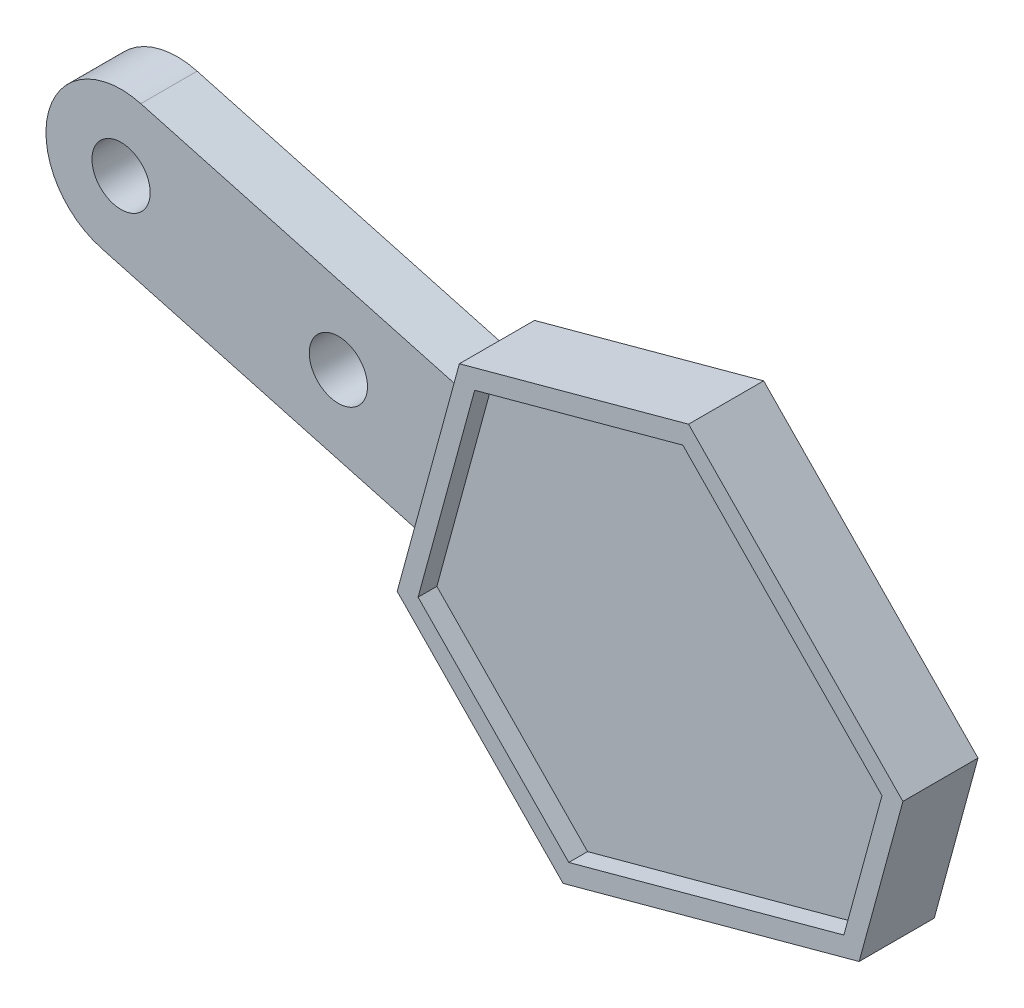
ISO-10303-21;
HEADER;
FILE_DESCRIPTION(('STEP AP214'),'2;1');
FILE_NAME('part.step','',(''),(''),'','','');
FILE_SCHEMA(('AUTOMOTIVE_DESIGN { 1 0 10303 214 1 1 1 1 }'));
ENDSEC;
DATA;
#1=APPLICATION_CONTEXT('core data for automotive mechanical design processes');
#2=APPLICATION_PROTOCOL_DEFINITION('international standard','automotive_design',2000,#1);
#3=PRODUCT_CONTEXT('',#1,'mechanical');
#4=PRODUCT('Part','Part','',(#3));
#5=PRODUCT_RELATED_PRODUCT_CATEGORY('part','',(#4));
#6=PRODUCT_DEFINITION_FORMATION('','',#4);
#7=PRODUCT_DEFINITION_CONTEXT('part definition',#1,'design');
#8=PRODUCT_DEFINITION('design','',#6,#7);
#9=PRODUCT_DEFINITION_SHAPE('','',#8);
#10=(LENGTH_UNIT() NAMED_UNIT(*) SI_UNIT(.MILLI.,.METRE.));
#11=(NAMED_UNIT(*) PLANE_ANGLE_UNIT() SI_UNIT($,.RADIAN.));
#12=(NAMED_UNIT(*) SI_UNIT($,.STERADIAN.) SOLID_ANGLE_UNIT());
#13=UNCERTAINTY_MEASURE_WITH_UNIT(LENGTH_MEASURE(1.E-05),#10,'distance_accuracy_value','');
#14=(GEOMETRIC_REPRESENTATION_CONTEXT(3) GLOBAL_UNCERTAINTY_ASSIGNED_CONTEXT((#13)) GLOBAL_UNIT_ASSIGNED_CONTEXT((#10,
#11,#12)) REPRESENTATION_CONTEXT('',''));
#15=CARTESIAN_POINT('',(0.,0.,0.));
#16=DIRECTION('',(0.,0.,1.));
#17=DIRECTION('',(1.,0.,0.));
#18=AXIS2_PLACEMENT_3D('',#15,#16,#17);
#19=CARTESIAN_POINT('',(38.1207531360918,-10.3903817993219,3.));
#20=DIRECTION('',(0.964803560931518,-0.262971650209416,0.));
#21=DIRECTION('',(0.262971650209416,0.964803560931518,0.));
#22=AXIS2_PLACEMENT_3D('',#19,#20,#21);
#23=PLANE('',#22);
#24=DIRECTION('',(-0.262971650209416,-0.964803560931518,0.));
#25=VECTOR('',#24,1.);
#26=CARTESIAN_POINT('',(38.1207531360918,-10.3903817993219,0.));
#27=LINE('',#26,#25);
#28=CARTESIAN_POINT('',(51.127591798776,37.3297593194111,0.));
#29=VERTEX_POINT('',#28);
#30=CARTESIAN_POINT('',(48.7962458042552,28.776400371837,0.));
#31=VERTEX_POINT('',#30);
#32=EDGE_CURVE('E233',#29,#31,#27,.T.);
#33=ORIENTED_EDGE('',*,*,#32,.F.);
#34=DIRECTION('',(0.,0.,-1.));
#35=VECTOR('',#34,1.);
#36=CARTESIAN_POINT('',(51.127591798776,37.3297593194111,3.));
#37=LINE('',#36,#35);
#38=CARTESIAN_POINT('',(51.127591798776,37.3297593194111,4.));
#39=VERTEX_POINT('',#38);
#40=EDGE_CURVE('E282',#39,#29,#37,.T.);
#41=ORIENTED_EDGE('',*,*,#40,.F.);
#42=DIRECTION('',(0.262971650209416,0.964803560931518,0.));
#43=VECTOR('',#42,1.);
#44=CARTESIAN_POINT('',(51.127591798776,37.3297593194111,4.));
#45=LINE('',#44,#43);
#46=CARTESIAN_POINT('',(48.7962458042552,28.776400371837,4.));
#47=VERTEX_POINT('',#46);
#48=EDGE_CURVE('E175',#47,#39,#45,.T.);
#49=ORIENTED_EDGE('',*,*,#48,.F.);
#50=DIRECTION('',(0.,0.,-1.));
#51=VECTOR('',#50,1.);
#52=CARTESIAN_POINT('',(48.7962458042552,28.776400371837,3.));
#53=LINE('',#52,#51);
#54=EDGE_CURVE('E263',#47,#31,#53,.T.);
#55=ORIENTED_EDGE('',*,*,#54,.T.);
#56=EDGE_LOOP('',(#33,#41,#49,#55));
#57=FACE_BOUND('',#56,.T.);
#58=ADVANCED_FACE('F34',(#57),#23,.T.);
#59=CARTESIAN_POINT('',(44.8323643576275,43.7767824762384,3.));
#60=DIRECTION('',(-0.71547962690603,-0.69863359744748,0.));
#61=DIRECTION('',(0.69863359744748,-0.71547962690603,0.));
#62=AXIS2_PLACEMENT_3D('',#59,#60,#61);
#63=PLANE('',#62);
#64=DIRECTION('',(-0.69863359744748,0.71547962690603,0.));
#65=VECTOR('',#64,1.);
#66=CARTESIAN_POINT('',(44.8323643576275,43.7767824762384,0.));
#67=LINE('',#66,#65);
#68=CARTESIAN_POINT('',(39.7087582613538,49.0239331880977,0.));
#69=VERTEX_POINT('',#68);
#70=EDGE_CURVE('E240',#29,#69,#67,.T.);
#71=ORIENTED_EDGE('',*,*,#70,.T.);
#72=DIRECTION('',(0.,0.,-1.));
#73=VECTOR('',#72,1.);
#74=CARTESIAN_POINT('',(39.7087582613538,49.0239331880977,3.));
#75=LINE('',#74,#73);
#76=CARTESIAN_POINT('',(39.7087582613538,49.0239331880977,4.));
#77=VERTEX_POINT('',#76);
#78=EDGE_CURVE('E280',#77,#69,#75,.T.);
#79=ORIENTED_EDGE('',*,*,#78,.F.);
#80=DIRECTION('',(-0.69863359744748,0.715479626906031,0.));
#81=VECTOR('',#80,1.);
#82=CARTESIAN_POINT('',(51.127591798776,37.3297593194111,4.));
#83=LINE('',#82,#81);
#84=EDGE_CURVE('E218',#39,#77,#83,.T.);
#85=ORIENTED_EDGE('',*,*,#84,.F.);
#86=ORIENTED_EDGE('',*,*,#40,.T.);
#87=EDGE_LOOP('',(#71,#79,#85,#86));
#88=FACE_BOUND('',#87,.T.);
#89=ADVANCED_FACE('F316',(#88),#63,.F.);
#90=CARTESIAN_POINT('',(-9.67375651287494,35.6080056345547,3.));
#91=DIRECTION('',(-0.262170893566225,0.965021462231119,0.));
#92=DIRECTION('',(-0.965021462231119,-0.262170893566225,0.));
#93=AXIS2_PLACEMENT_3D('',#90,#91,#92);
#94=PLANE('',#93);
#95=DIRECTION('',(0.965021462231119,0.262170893566225,0.));
#96=VECTOR('',#95,1.);
#97=CARTESIAN_POINT('',(-9.67375651287494,35.6080056345547,0.));
#98=LINE('',#97,#96);
#99=CARTESIAN_POINT('',(27.4988774001279,45.7068304074778,0.));
#100=VERTEX_POINT('',#99);
#101=EDGE_CURVE('E243',#100,#69,#98,.T.);
#102=ORIENTED_EDGE('',*,*,#101,.F.);
#103=DIRECTION('',(0.,0.,-1.));
#104=VECTOR('',#103,1.);
#105=CARTESIAN_POINT('',(27.4988774001279,45.7068304074778,3.));
#106=LINE('',#105,#104);
#107=CARTESIAN_POINT('',(27.4988774001279,45.7068304074778,4.));
#108=VERTEX_POINT('',#107);
#109=EDGE_CURVE('E278',#108,#100,#106,.T.);
#110=ORIENTED_EDGE('',*,*,#109,.F.);
#111=DIRECTION('',(-0.965021462231119,-0.262170893566226,0.));
#112=VECTOR('',#111,1.);
#113=CARTESIAN_POINT('',(27.4988774001279,45.7068304074778,4.));
#114=LINE('',#113,#112);
#115=EDGE_CURVE('E221',#77,#108,#114,.T.);
#116=ORIENTED_EDGE('',*,*,#115,.F.);
#117=ORIENTED_EDGE('',*,*,#78,.T.);
#118=EDGE_LOOP('',(#102,#110,#116,#117));
#119=FACE_BOUND('',#118,.T.);
#120=ADVANCED_FACE('F312',(#119),#94,.T.);
#121=CARTESIAN_POINT('',(12.8930522662611,47.302675888672,3.));
#122=DIRECTION('',(0.262971650209409,0.964803560931519,0.));
#123=DIRECTION('',(-0.964803560931519,0.262971650209409,0.));
#124=AXIS2_PLACEMENT_3D('',#121,#122,#123);
#125=PLANE('',#124);
#126=DIRECTION('',(0.964803560931519,-0.262971650209409,0.));
#127=VECTOR('',#126,1.);
#128=CARTESIAN_POINT('',(12.8930522662611,47.302675888672,0.));
#129=LINE('',#128,#127);
#130=CARTESIAN_POINT('',(9.52725228229794,48.2200750483548,0.));
#131=VERTEX_POINT('',#130);
#132=CARTESIAN_POINT('',(26.8937163790653,43.4865853445854,0.));
#133=VERTEX_POINT('',#132);
#134=EDGE_CURVE('E249',#131,#133,#129,.T.);
#135=ORIENTED_EDGE('',*,*,#134,.F.);
#136=DIRECTION('',(0.,0.,-1.));
#137=VECTOR('',#136,1.);
#138=CARTESIAN_POINT('',(9.52725228229794,48.2200750483548,3.));
#139=LINE('',#138,#137);
#140=CARTESIAN_POINT('',(9.52725228229794,48.2200750483548,3.));
#141=VERTEX_POINT('',#140);
#142=EDGE_CURVE('E59',#131,#141,#139,.F.);
#143=ORIENTED_EDGE('',*,*,#142,.T.);
#144=DIRECTION('',(0.964803560931519,-0.262971650209409,0.));
#145=VECTOR('',#144,1.);
#146=CARTESIAN_POINT('',(12.8930522662611,47.302675888672,3.));
#147=LINE('',#146,#145);
#148=CARTESIAN_POINT('',(26.8937163790653,43.4865853445854,3.));
#149=VERTEX_POINT('',#148);
#150=EDGE_CURVE('E237',#141,#149,#147,.T.);
#151=ORIENTED_EDGE('',*,*,#150,.T.);
#152=DIRECTION('',(0.,0.,-1.));
#153=VECTOR('',#152,1.);
#154=CARTESIAN_POINT('',(26.8937163790653,43.4865853445854,3.));
#155=LINE('',#154,#153);
#156=EDGE_CURVE('E277',#149,#133,#155,.T.);
#157=ORIENTED_EDGE('',*,*,#156,.T.);
#158=EDGE_LOOP('',(#135,#143,#151,#157));
#159=FACE_BOUND('',#158,.T.);
#160=ADVANCED_FACE('F301',(#159),#125,.T.);
#161=CARTESIAN_POINT('',(8.47536568146036,44.3608608046289,3.));
#162=DIRECTION('',(0.,0.,-1.));
#163=DIRECTION('',(-1.,0.,0.));
#164=AXIS2_PLACEMENT_3D('',#161,#162,#163);
#165=CYLINDRICAL_SURFACE('',#164,4.);
#166=CARTESIAN_POINT('',(8.47536568146036,44.3608608046289,0.));
#167=DIRECTION('',(0.,0.,1.));
#168=DIRECTION('',(1.,0.,0.));
#169=AXIS2_PLACEMENT_3D('',#166,#167,#168);
#170=CIRCLE('',#169,4.);
#171=CARTESIAN_POINT('',(4.61615143773429,45.4127474054666,0.));
#172=VERTEX_POINT('',#171);
#173=CARTESIAN_POINT('',(7.4234790806227,40.5016465609029,0.));
#174=VERTEX_POINT('',#173);
#175=EDGE_CURVE('E251',#172,#174,#170,.T.);
#176=ORIENTED_EDGE('',*,*,#175,.T.);
#177=DIRECTION('',(0.,0.,-1.));
#178=VECTOR('',#177,1.);
#179=CARTESIAN_POINT('',(7.4234790806227,40.5016465609029,3.));
#180=LINE('',#179,#178);
#181=CARTESIAN_POINT('',(7.4234790806227,40.5016465609029,3.));
#182=VERTEX_POINT('',#181);
#183=EDGE_CURVE('E271',#182,#174,#180,.T.);
#184=ORIENTED_EDGE('',*,*,#183,.F.);
#185=CARTESIAN_POINT('',(8.47536568146036,44.3608608046289,3.));
#186=DIRECTION('',(0.,0.,1.));
#187=DIRECTION('',(1.,0.,0.));
#188=AXIS2_PLACEMENT_3D('',#185,#186,#187);
#189=CIRCLE('',#188,4.);
#190=CARTESIAN_POINT('',(4.61615143773429,45.4127474054666,3.));
#191=VERTEX_POINT('',#190);
#192=EDGE_CURVE('E234',#191,#182,#189,.T.);
#193=ORIENTED_EDGE('',*,*,#192,.F.);
#194=DIRECTION('',(0.,0.,-1.));
#195=VECTOR('',#194,1.);
#196=CARTESIAN_POINT('',(4.61615143773429,45.4127474054666,3.));
#197=LINE('',#196,#195);
#198=EDGE_CURVE('E274',#191,#172,#197,.T.);
#199=ORIENTED_EDGE('',*,*,#198,.T.);
#200=EDGE_LOOP('',(#176,#184,#193,#199));
#201=FACE_BOUND('',#200,.T.);
#202=ADVANCED_FACE('F338',(#201),#165,.T.);
#203=CARTESIAN_POINT('',(10.7892790645862,39.5842474012199,3.));
#204=DIRECTION('',(0.262971650209416,0.964803560931518,0.));
#205=DIRECTION('',(-0.964803560931518,0.262971650209416,0.));
#206=AXIS2_PLACEMENT_3D('',#203,#204,#205);
#207=PLANE('',#206);
#208=DIRECTION('',(0.964803560931518,-0.262971650209416,0.));
#209=VECTOR('',#208,1.);
#210=CARTESIAN_POINT('',(10.7892790645862,39.5842474012199,0.));
#211=LINE('',#210,#209);
#212=CARTESIAN_POINT('',(24.78994317739,35.7681568571334,0.));
#213=VERTEX_POINT('',#212);
#214=EDGE_CURVE('E253',#174,#213,#211,.T.);
#215=ORIENTED_EDGE('',*,*,#214,.T.);
#216=DIRECTION('',(0.,0.,-1.));
#217=VECTOR('',#216,1.);
#218=CARTESIAN_POINT('',(24.78994317739,35.7681568571334,3.));
#219=LINE('',#218,#217);
#220=CARTESIAN_POINT('',(24.78994317739,35.7681568571334,3.));
#221=VERTEX_POINT('',#220);
#222=EDGE_CURVE('E270',#221,#213,#219,.T.);
#223=ORIENTED_EDGE('',*,*,#222,.F.);
#224=DIRECTION('',(0.964803560931518,-0.262971650209416,0.));
#225=VECTOR('',#224,1.);
#226=CARTESIAN_POINT('',(10.7892790645862,39.5842474012199,3.));
#227=LINE('',#226,#225);
#228=EDGE_CURVE('E236',#182,#221,#227,.T.);
#229=ORIENTED_EDGE('',*,*,#228,.F.);
#230=ORIENTED_EDGE('',*,*,#183,.T.);
#231=EDGE_LOOP('',(#215,#223,#229,#230));
#232=FACE_BOUND('',#231,.T.);
#233=ADVANCED_FACE('F334',(#232),#207,.F.);
#234=CARTESIAN_POINT('',(14.0006641128039,-3.81609054408653,3.));
#235=DIRECTION('',(0.964803560931518,-0.262971650209416,0.));
#236=DIRECTION('',(0.262971650209416,0.964803560931518,0.));
#237=AXIS2_PLACEMENT_3D('',#234,#235,#236);
#238=PLANE('',#237);
#239=DIRECTION('',(-0.262971650209416,-0.964803560931518,0.));
#240=VECTOR('',#239,1.);
#241=CARTESIAN_POINT('',(14.0006641128039,-3.81609054408653,0.));
#242=LINE('',#241,#240);
#243=CARTESIAN_POINT('',(24.1847821563274,33.547911794241,0.));
#244=VERTEX_POINT('',#243);
#245=EDGE_CURVE('E255',#213,#244,#242,.T.);
#246=ORIENTED_EDGE('',*,*,#245,.T.);
#247=DIRECTION('',(0.,0.,-1.));
#248=VECTOR('',#247,1.);
#249=CARTESIAN_POINT('',(24.1847821563274,33.547911794241,3.));
#250=LINE('',#249,#248);
#251=CARTESIAN_POINT('',(24.1847821563274,33.547911794241,4.));
#252=VERTEX_POINT('',#251);
#253=EDGE_CURVE('E267',#252,#244,#250,.T.);
#254=ORIENTED_EDGE('',*,*,#253,.F.);
#255=DIRECTION('',(-0.262971650209415,-0.964803560931518,0.));
#256=VECTOR('',#255,1.);
#257=CARTESIAN_POINT('',(27.4988774001279,45.7068304074778,4.));
#258=LINE('',#257,#256);
#259=EDGE_CURVE('E224',#108,#252,#258,.T.);
#260=ORIENTED_EDGE('',*,*,#259,.F.);
#261=ORIENTED_EDGE('',*,*,#109,.T.);
#262=DIRECTION('',(-0.262971650209416,-0.964803560931518,0.));
#263=VECTOR('',#262,1.);
#264=CARTESIAN_POINT('',(14.0006641128039,-3.81609054408653,0.));
#265=LINE('',#264,#263);
#266=EDGE_CURVE('E246',#100,#133,#265,.T.);
#267=ORIENTED_EDGE('',*,*,#266,.T.);
#268=ORIENTED_EDGE('',*,*,#156,.F.);
#269=DIRECTION('',(-0.262971650209417,-0.964803560931517,0.));
#270=VECTOR('',#269,1.);
#271=CARTESIAN_POINT('',(24.78994317739,35.7681568571334,3.));
#272=LINE('',#271,#270);
#273=EDGE_CURVE('E11',#149,#221,#272,.T.);
#274=ORIENTED_EDGE('',*,*,#273,.T.);
#275=ORIENTED_EDGE('',*,*,#222,.T.);
#276=EDGE_LOOP('',(#246,#254,#260,#261,#267,#268,#274,#275));
#277=FACE_BOUND('',#276,.T.);
#278=ADVANCED_FACE('F304',(#277),#238,.F.);
#279=CARTESIAN_POINT('',(29.153455828047,28.4577732538788,3.));
#280=DIRECTION('',(0.715593255846183,0.698517209657327,0.));
#281=DIRECTION('',(-0.698517209657327,0.715593255846183,0.));
#282=AXIS2_PLACEMENT_3D('',#279,#280,#281);
#283=PLANE('',#282);
#284=DIRECTION('',(0.698517209657327,-0.715593255846183,0.));
#285=VECTOR('',#284,1.);
#286=CARTESIAN_POINT('',(29.153455828047,28.4577732538788,0.));
#287=LINE('',#286,#285);
#288=CARTESIAN_POINT('',(33.0227326509345,24.4939075664199,0.));
#289=VERTEX_POINT('',#288);
#290=EDGE_CURVE('E257',#244,#289,#287,.T.);
#291=ORIENTED_EDGE('',*,*,#290,.T.);
#292=DIRECTION('',(0.,0.,-1.));
#293=VECTOR('',#292,1.);
#294=CARTESIAN_POINT('',(33.0227326509345,24.4939075664199,3.));
#295=LINE('',#294,#293);
#296=CARTESIAN_POINT('',(33.0227326509345,24.4939075664199,4.));
#297=VERTEX_POINT('',#296);
#298=EDGE_CURVE('E265',#297,#289,#295,.T.);
#299=ORIENTED_EDGE('',*,*,#298,.F.);
#300=DIRECTION('',(0.698517209657328,-0.715593255846183,0.));
#301=VECTOR('',#300,1.);
#302=CARTESIAN_POINT('',(24.1847821563274,33.547911794241,4.));
#303=LINE('',#302,#301);
#304=EDGE_CURVE('E227',#252,#297,#303,.T.);
#305=ORIENTED_EDGE('',*,*,#304,.F.);
#306=ORIENTED_EDGE('',*,*,#253,.T.);
#307=EDGE_LOOP('',(#291,#299,#305,#306));
#308=FACE_BOUND('',#307,.T.);
#309=ADVANCED_FACE('F327',(#308),#283,.F.);
#310=CARTESIAN_POINT('',(-3.92648168155245,14.4622333917053,3.));
#311=DIRECTION('',(0.262013921552175,-0.96506409368127,0.));
#312=DIRECTION('',(0.96506409368127,0.262013921552175,0.));
#313=AXIS2_PLACEMENT_3D('',#310,#311,#312);
#314=PLANE('',#313);
#315=DIRECTION('',(-0.96506409368127,-0.262013921552175,0.));
#316=VECTOR('',#315,1.);
#317=CARTESIAN_POINT('',(-3.92648168155245,14.4622333917053,0.));
#318=LINE('',#317,#316);
#319=EDGE_CURVE('E260',#31,#289,#318,.T.);
#320=ORIENTED_EDGE('',*,*,#319,.F.);
#321=ORIENTED_EDGE('',*,*,#54,.F.);
#322=DIRECTION('',(0.96506409368127,0.262013921552175,0.));
#323=VECTOR('',#322,1.);
#324=CARTESIAN_POINT('',(48.7962458042552,28.776400371837,4.));
#325=LINE('',#324,#323);
#326=EDGE_CURVE('E230',#297,#47,#325,.T.);
#327=ORIENTED_EDGE('',*,*,#326,.F.);
#328=ORIENTED_EDGE('',*,*,#298,.T.);
#329=EDGE_LOOP('',(#320,#321,#327,#328));
#330=FACE_BOUND('',#329,.T.);
#331=ADVANCED_FACE('F323',(#330),#314,.T.);
#332=CARTESIAN_POINT('',(0.,0.,3.));
#333=DIRECTION('',(0.,0.,1.));
#334=DIRECTION('',(1.,0.,0.));
#335=AXIS2_PLACEMENT_3D('',#332,#333,#334);
#336=PLANE('',#335);
#337=CARTESIAN_POINT('',(20.0530084126385,41.2052010021159,3.));
#338=DIRECTION('',(0.,0.,1.));
#339=DIRECTION('',(1.,0.,0.));
#340=AXIS2_PLACEMENT_3D('',#337,#338,#339);
#341=CIRCLE('',#340,1.55);
#342=CARTESIAN_POINT('',(21.6030084126385,41.2052010021159,3.));
#343=VERTEX_POINT('',#342);
#344=EDGE_CURVE('E499',#343,#343,#341,.T.);
#345=ORIENTED_EDGE('',*,*,#344,.F.);
#346=EDGE_LOOP('',(#345));
#347=FACE_BOUND('',#346,.T.);
#348=CARTESIAN_POINT('',(8.47536568146031,44.3608608046287,3.));
#349=DIRECTION('',(0.,0.,1.));
#350=DIRECTION('',(1.,0.,0.));
#351=AXIS2_PLACEMENT_3D('',#348,#349,#350);
#352=CIRCLE('',#351,1.55);
#353=CARTESIAN_POINT('',(10.0253656814603,44.3608608046287,3.));
#354=VERTEX_POINT('',#353);
#355=EDGE_CURVE('E503',#354,#354,#352,.T.);
#356=ORIENTED_EDGE('',*,*,#355,.F.);
#357=EDGE_LOOP('',(#356));
#358=FACE_BOUND('',#357,.T.);
#359=ORIENTED_EDGE('',*,*,#273,.F.);
#360=ORIENTED_EDGE('',*,*,#150,.F.);
#361=CARTESIAN_POINT('',(8.47536568146031,44.3608608046287,3.));
#362=DIRECTION('',(0.,0.,1.));
#363=DIRECTION('',(1.,0.,0.));
#364=AXIS2_PLACEMENT_3D('',#361,#362,#363);
#365=CIRCLE('',#364,4.);
#366=EDGE_CURVE('E43',#141,#191,#365,.T.);
#367=ORIENTED_EDGE('',*,*,#366,.T.);
#368=ORIENTED_EDGE('',*,*,#192,.T.);
#369=ORIENTED_EDGE('',*,*,#228,.T.);
#370=EDGE_LOOP('',(#359,#360,#367,#368,#369));
#371=FACE_BOUND('',#370,.T.);
#372=ADVANCED_FACE('F343',(#347,#358,#371),#336,.T.);
#373=CARTESIAN_POINT('',(0.,0.,0.));
#374=DIRECTION('',(0.,0.,1.));
#375=DIRECTION('',(1.,0.,0.));
#376=AXIS2_PLACEMENT_3D('',#373,#374,#375);
#377=PLANE('',#376);
#378=CARTESIAN_POINT('',(20.0530084126385,41.2052010021159,0.));
#379=DIRECTION('',(0.,0.,1.));
#380=DIRECTION('',(1.,0.,0.));
#381=AXIS2_PLACEMENT_3D('',#378,#379,#380);
#382=CIRCLE('',#381,1.55);
#383=CARTESIAN_POINT('',(21.6030084126385,41.2052010021159,0.));
#384=VERTEX_POINT('',#383);
#385=EDGE_CURVE('E502',#384,#384,#382,.F.);
#386=ORIENTED_EDGE('',*,*,#385,.F.);
#387=EDGE_LOOP('',(#386));
#388=FACE_BOUND('',#387,.T.);
#389=CARTESIAN_POINT('',(8.47536568146031,44.3608608046287,0.));
#390=DIRECTION('',(0.,0.,1.));
#391=DIRECTION('',(1.,0.,0.));
#392=AXIS2_PLACEMENT_3D('',#389,#390,#391);
#393=CIRCLE('',#392,1.55);
#394=CARTESIAN_POINT('',(10.0253656814603,44.3608608046287,0.));
#395=VERTEX_POINT('',#394);
#396=EDGE_CURVE('E195',#395,#395,#393,.F.);
#397=ORIENTED_EDGE('',*,*,#396,.F.);
#398=EDGE_LOOP('',(#397));
#399=FACE_BOUND('',#398,.T.);
#400=ORIENTED_EDGE('',*,*,#175,.F.);
#401=CARTESIAN_POINT('',(8.47536568146031,44.3608608046287,0.));
#402=DIRECTION('',(0.,0.,1.));
#403=DIRECTION('',(1.,0.,0.));
#404=AXIS2_PLACEMENT_3D('',#401,#402,#403);
#405=CIRCLE('',#404,4.);
#406=EDGE_CURVE('E284',#172,#131,#405,.F.);
#407=ORIENTED_EDGE('',*,*,#406,.T.);
#408=ORIENTED_EDGE('',*,*,#134,.T.);
#409=ORIENTED_EDGE('',*,*,#266,.F.);
#410=ORIENTED_EDGE('',*,*,#101,.T.);
#411=ORIENTED_EDGE('',*,*,#70,.F.);
#412=ORIENTED_EDGE('',*,*,#32,.T.);
#413=ORIENTED_EDGE('',*,*,#319,.T.);
#414=ORIENTED_EDGE('',*,*,#290,.F.);
#415=ORIENTED_EDGE('',*,*,#245,.F.);
#416=ORIENTED_EDGE('',*,*,#214,.F.);
#417=EDGE_LOOP('',(#400,#407,#408,#409,#410,#411,#412,#413,#414,#415,#416));
#418=FACE_BOUND('',#417,.T.);
#419=ADVANCED_FACE('F309',(#388,#399,#418),#377,.F.);
#420=CARTESIAN_POINT('',(8.47536568146031,44.3608608046287,3.));
#421=DIRECTION('',(0.,0.,1.));
#422=DIRECTION('',(1.,0.,0.));
#423=AXIS2_PLACEMENT_3D('',#420,#421,#422);
#424=CYLINDRICAL_SURFACE('',#423,4.);
#425=ORIENTED_EDGE('',*,*,#366,.F.);
#426=ORIENTED_EDGE('',*,*,#142,.F.);
#427=ORIENTED_EDGE('',*,*,#406,.F.);
#428=ORIENTED_EDGE('',*,*,#198,.F.);
#429=EDGE_LOOP('',(#425,#426,#427,#428));
#430=FACE_BOUND('',#429,.T.);
#431=ADVANCED_FACE('F36',(#430),#424,.T.);
#432=CARTESIAN_POINT('',(0.,0.,4.));
#433=DIRECTION('',(0.,0.,-1.));
#434=DIRECTION('',(-1.,0.,0.));
#435=AXIS2_PLACEMENT_3D('',#432,#433,#434);
#436=PLANE('',#435);
#437=ORIENTED_EDGE('',*,*,#48,.T.);
#438=ORIENTED_EDGE('',*,*,#84,.T.);
#439=ORIENTED_EDGE('',*,*,#115,.T.);
#440=ORIENTED_EDGE('',*,*,#259,.T.);
#441=ORIENTED_EDGE('',*,*,#304,.T.);
#442=ORIENTED_EDGE('',*,*,#326,.T.);
#443=EDGE_LOOP('',(#437,#438,#439,#440,#441,#442));
#444=FACE_BOUND('',#443,.T.);
#445=DIRECTION('',(0.96506409368127,0.262013921552175,0.));
#446=VECTOR('',#445,1.);
#447=CARTESIAN_POINT('',(33.3278407466464,25.6129447119584,4.));
#448=LINE('',#447,#446);
#449=CARTESIAN_POINT('',(33.3278407466464,25.6129447119584,4.));
#450=VERTEX_POINT('',#449);
#451=CARTESIAN_POINT('',(47.9819376602015,29.5915171448835,4.));
#452=VERTEX_POINT('',#451);
#453=EDGE_CURVE('E159',#450,#452,#448,.T.);
#454=ORIENTED_EDGE('',*,*,#453,.F.);
#455=DIRECTION('',(0.698517209657327,-0.715593255846184,0.));
#456=VECTOR('',#455,1.);
#457=CARTESIAN_POINT('',(25.300052743626,33.8369811063409,4.));
#458=LINE('',#457,#456);
#459=CARTESIAN_POINT('',(25.300052743626,33.8369811063409,4.));
#460=VERTEX_POINT('',#459);
#461=EDGE_CURVE('E191',#460,#450,#458,.T.);
#462=ORIENTED_EDGE('',*,*,#461,.F.);
#463=DIRECTION('',(-0.262971650209416,-0.964803560931518,0.));
#464=VECTOR('',#463,1.);
#465=CARTESIAN_POINT('',(28.3132139346924,44.8918177949591,4.));
#466=LINE('',#465,#464);
#467=CARTESIAN_POINT('',(28.3132139346924,44.8918177949591,4.));
#468=VERTEX_POINT('',#467);
#469=EDGE_CURVE('E188',#468,#460,#466,.T.);
#470=ORIENTED_EDGE('',*,*,#469,.F.);
#471=DIRECTION('',(-0.965021462231119,-0.262170893566225,0.));
#472=VECTOR('',#471,1.);
#473=CARTESIAN_POINT('',(39.4038321901204,47.9048464290633,4.));
#474=LINE('',#473,#472);
#475=CARTESIAN_POINT('',(39.4038321901204,47.9048464290633,4.));
#476=VERTEX_POINT('',#475);
#477=EDGE_CURVE('E183',#476,#468,#474,.T.);
#478=ORIENTED_EDGE('',*,*,#477,.F.);
#479=DIRECTION('',(-0.69863359744748,0.71547962690603,0.));
#480=VECTOR('',#479,1.);
#481=CARTESIAN_POINT('',(50.0122928209666,37.0405858467833,4.));
#482=LINE('',#481,#480);
#483=CARTESIAN_POINT('',(50.0122928209666,37.0405858467833,4.));
#484=VERTEX_POINT('',#483);
#485=EDGE_CURVE('E181',#484,#476,#482,.T.);
#486=ORIENTED_EDGE('',*,*,#485,.F.);
#487=DIRECTION('',(0.262971650209416,0.964803560931518,0.));
#488=VECTOR('',#487,1.);
#489=CARTESIAN_POINT('',(47.9819376602015,29.5915171448835,4.));
#490=LINE('',#489,#488);
#491=EDGE_CURVE('E168',#452,#484,#490,.T.);
#492=ORIENTED_EDGE('',*,*,#491,.F.);
#493=EDGE_LOOP('',(#454,#462,#470,#478,#486,#492));
#494=FACE_BOUND('',#493,.T.);
#495=ADVANCED_FACE('F179',(#444,#494),#436,.F.);
#496=CARTESIAN_POINT('',(33.3278407466464,25.6129447119584,4.));
#497=DIRECTION('',(-0.262013921552175,0.96506409368127,0.));
#498=DIRECTION('',(-0.96506409368127,-0.262013921552175,0.));
#499=AXIS2_PLACEMENT_3D('',#496,#497,#498);
#500=PLANE('',#499);
#501=DIRECTION('',(0.96506409368127,0.262013921552175,0.));
#502=VECTOR('',#501,1.);
#503=CARTESIAN_POINT('',(33.3278407466464,25.6129447119584,3.));
#504=LINE('',#503,#502);
#505=CARTESIAN_POINT('',(33.3278407466464,25.6129447119584,3.));
#506=VERTEX_POINT('',#505);
#507=CARTESIAN_POINT('',(47.9819376602015,29.5915171448835,3.));
#508=VERTEX_POINT('',#507);
#509=EDGE_CURVE('E193',#506,#508,#504,.T.);
#510=ORIENTED_EDGE('',*,*,#509,.F.);
#511=DIRECTION('',(0.,0.,-1.));
#512=VECTOR('',#511,1.);
#513=CARTESIAN_POINT('',(33.3278407466464,25.6129447119584,4.));
#514=LINE('',#513,#512);
#515=EDGE_CURVE('E164',#450,#506,#514,.T.);
#516=ORIENTED_EDGE('',*,*,#515,.F.);
#517=ORIENTED_EDGE('',*,*,#453,.T.);
#518=DIRECTION('',(0.,0.,-1.));
#519=VECTOR('',#518,1.);
#520=CARTESIAN_POINT('',(47.9819376602015,29.5915171448835,4.));
#521=LINE('',#520,#519);
#522=EDGE_CURVE('E162',#452,#508,#521,.T.);
#523=ORIENTED_EDGE('',*,*,#522,.T.);
#524=EDGE_LOOP('',(#510,#516,#517,#523));
#525=FACE_BOUND('',#524,.T.);
#526=ADVANCED_FACE('F161',(#525),#500,.T.);
#527=CARTESIAN_POINT('',(47.9819376602015,29.5915171448835,4.));
#528=DIRECTION('',(-0.964803560931518,0.262971650209416,0.));
#529=DIRECTION('',(-0.262971650209416,-0.964803560931518,0.));
#530=AXIS2_PLACEMENT_3D('',#527,#528,#529);
#531=PLANE('',#530);
#532=DIRECTION('',(0.262971650209416,0.964803560931518,0.));
#533=VECTOR('',#532,1.);
#534=CARTESIAN_POINT('',(47.9819376602015,29.5915171448835,3.));
#535=LINE('',#534,#533);
#536=CARTESIAN_POINT('',(50.0122928209666,37.0405858467833,3.));
#537=VERTEX_POINT('',#536);
#538=EDGE_CURVE('E174',#508,#537,#535,.T.);
#539=ORIENTED_EDGE('',*,*,#538,.F.);
#540=ORIENTED_EDGE('',*,*,#522,.F.);
#541=ORIENTED_EDGE('',*,*,#491,.T.);
#542=DIRECTION('',(0.,0.,-1.));
#543=VECTOR('',#542,1.);
#544=CARTESIAN_POINT('',(50.0122928209666,37.0405858467833,4.));
#545=LINE('',#544,#543);
#546=EDGE_CURVE('E176',#484,#537,#545,.T.);
#547=ORIENTED_EDGE('',*,*,#546,.T.);
#548=EDGE_LOOP('',(#539,#540,#541,#547));
#549=FACE_BOUND('',#548,.T.);
#550=ADVANCED_FACE('F171',(#549),#531,.T.);
#551=CARTESIAN_POINT('',(50.0122928209666,37.0405858467833,4.));
#552=DIRECTION('',(-0.71547962690603,-0.69863359744748,0.));
#553=DIRECTION('',(0.69863359744748,-0.71547962690603,0.));
#554=AXIS2_PLACEMENT_3D('',#551,#552,#553);
#555=PLANE('',#554);
#556=DIRECTION('',(-0.69863359744748,0.71547962690603,0.));
#557=VECTOR('',#556,1.);
#558=CARTESIAN_POINT('',(50.0122928209666,37.0405858467833,3.));
#559=LINE('',#558,#557);
#560=CARTESIAN_POINT('',(39.4038321901204,47.9048464290633,3.));
#561=VERTEX_POINT('',#560);
#562=EDGE_CURVE('E197',#537,#561,#559,.T.);
#563=ORIENTED_EDGE('',*,*,#562,.F.);
#564=ORIENTED_EDGE('',*,*,#546,.F.);
#565=ORIENTED_EDGE('',*,*,#485,.T.);
#566=DIRECTION('',(0.,0.,-1.));
#567=VECTOR('',#566,1.);
#568=CARTESIAN_POINT('',(39.4038321901204,47.9048464290633,4.));
#569=LINE('',#568,#567);
#570=EDGE_CURVE('E213',#476,#561,#569,.T.);
#571=ORIENTED_EDGE('',*,*,#570,.T.);
#572=EDGE_LOOP('',(#563,#564,#565,#571));
#573=FACE_BOUND('',#572,.T.);
#574=ADVANCED_FACE('F413',(#573),#555,.T.);
#575=CARTESIAN_POINT('',(39.4038321901204,47.9048464290633,4.));
#576=DIRECTION('',(0.262170893566225,-0.965021462231119,0.));
#577=DIRECTION('',(0.965021462231119,0.262170893566226,0.));
#578=AXIS2_PLACEMENT_3D('',#575,#576,#577);
#579=PLANE('',#578);
#580=DIRECTION('',(-0.965021462231119,-0.262170893566225,0.));
#581=VECTOR('',#580,1.);
#582=CARTESIAN_POINT('',(39.4038321901204,47.9048464290633,3.));
#583=LINE('',#582,#581);
#584=CARTESIAN_POINT('',(28.3132139346924,44.8918177949591,3.));
#585=VERTEX_POINT('',#584);
#586=EDGE_CURVE('E200',#561,#585,#583,.T.);
#587=ORIENTED_EDGE('',*,*,#586,.F.);
#588=ORIENTED_EDGE('',*,*,#570,.F.);
#589=ORIENTED_EDGE('',*,*,#477,.T.);
#590=DIRECTION('',(0.,0.,-1.));
#591=VECTOR('',#590,1.);
#592=CARTESIAN_POINT('',(28.3132139346924,44.8918177949591,4.));
#593=LINE('',#592,#591);
#594=EDGE_CURVE('E210',#468,#585,#593,.T.);
#595=ORIENTED_EDGE('',*,*,#594,.T.);
#596=EDGE_LOOP('',(#587,#588,#589,#595));
#597=FACE_BOUND('',#596,.T.);
#598=ADVANCED_FACE('F422',(#597),#579,.T.);
#599=CARTESIAN_POINT('',(25.7547467383215,35.505185206924,4.));
#600=DIRECTION('',(0.964803560931517,-0.262971650209418,0.));
#601=DIRECTION('',(0.262971650209418,0.964803560931517,0.));
#602=AXIS2_PLACEMENT_3D('',#599,#600,#601);
#603=PLANE('',#602);
#604=DIRECTION('',(-0.262971650209418,-0.964803560931517,0.));
#605=VECTOR('',#604,1.);
#606=CARTESIAN_POINT('',(25.7547467383215,35.505185206924,3.));
#607=LINE('',#606,#605);
#608=CARTESIAN_POINT('',(25.300052743626,33.8369811063409,3.));
#609=VERTEX_POINT('',#608);
#610=EDGE_CURVE('E203',#585,#609,#607,.T.);
#611=ORIENTED_EDGE('',*,*,#610,.F.);
#612=ORIENTED_EDGE('',*,*,#594,.F.);
#613=ORIENTED_EDGE('',*,*,#469,.T.);
#614=DIRECTION('',(0.,0.,-1.));
#615=VECTOR('',#614,1.);
#616=CARTESIAN_POINT('',(25.300052743626,33.8369811063409,4.));
#617=LINE('',#616,#615);
#618=EDGE_CURVE('E208',#460,#609,#617,.T.);
#619=ORIENTED_EDGE('',*,*,#618,.T.);
#620=EDGE_LOOP('',(#611,#612,#613,#619));
#621=FACE_BOUND('',#620,.T.);
#622=ADVANCED_FACE('F432',(#621),#603,.T.);
#623=CARTESIAN_POINT('',(25.300052743626,33.8369811063409,4.));
#624=DIRECTION('',(0.715593255846184,0.698517209657327,0.));
#625=DIRECTION('',(-0.698517209657327,0.715593255846184,0.));
#626=AXIS2_PLACEMENT_3D('',#623,#624,#625);
#627=PLANE('',#626);
#628=DIRECTION('',(0.698517209657327,-0.715593255846184,0.));
#629=VECTOR('',#628,1.);
#630=CARTESIAN_POINT('',(25.300052743626,33.8369811063409,3.));
#631=LINE('',#630,#629);
#632=EDGE_CURVE('E51',#609,#506,#631,.T.);
#633=ORIENTED_EDGE('',*,*,#632,.F.);
#634=ORIENTED_EDGE('',*,*,#618,.F.);
#635=ORIENTED_EDGE('',*,*,#461,.T.);
#636=ORIENTED_EDGE('',*,*,#515,.T.);
#637=EDGE_LOOP('',(#633,#634,#635,#636));
#638=FACE_BOUND('',#637,.T.);
#639=ADVANCED_FACE('F360',(#638),#627,.T.);
#640=ORIENTED_EDGE('',*,*,#610,.T.);
#641=ORIENTED_EDGE('',*,*,#632,.T.);
#642=ORIENTED_EDGE('',*,*,#509,.T.);
#643=ORIENTED_EDGE('',*,*,#538,.T.);
#644=ORIENTED_EDGE('',*,*,#562,.T.);
#645=ORIENTED_EDGE('',*,*,#586,.T.);
#646=EDGE_LOOP('',(#640,#641,#642,#643,#644,#645));
#647=FACE_BOUND('',#646,.T.);
#648=ADVANCED_FACE('F347',(#647),#336,.T.);
#649=CARTESIAN_POINT('',(8.47536568146031,44.3608608046287,-0.00102499999999998));
#650=DIRECTION('',(0.,0.,1.));
#651=DIRECTION('',(1.,0.,0.));
#652=AXIS2_PLACEMENT_3D('',#649,#650,#651);
#653=CYLINDRICAL_SURFACE('',#652,1.55);
#654=ORIENTED_EDGE('',*,*,#355,.T.);
#655=EDGE_LOOP('',(#654));
#656=FACE_BOUND('',#655,.T.);
#657=ORIENTED_EDGE('',*,*,#396,.T.);
#658=EDGE_LOOP('',(#657));
#659=FACE_BOUND('',#658,.T.);
#660=ADVANCED_FACE('F359',(#656,#659),#653,.F.);
#661=CARTESIAN_POINT('',(20.0530084126385,41.2052010021159,-0.00102499999999998));
#662=DIRECTION('',(0.,0.,1.));
#663=DIRECTION('',(1.,0.,0.));
#664=AXIS2_PLACEMENT_3D('',#661,#662,#663);
#665=CYLINDRICAL_SURFACE('',#664,1.55);
#666=ORIENTED_EDGE('',*,*,#344,.T.);
#667=EDGE_LOOP('',(#666));
#668=FACE_BOUND('',#667,.T.);
#669=ORIENTED_EDGE('',*,*,#385,.T.);
#670=EDGE_LOOP('',(#669));
#671=FACE_BOUND('',#670,.T.);
#672=ADVANCED_FACE('F483',(#668,#671),#665,.F.);
#673=CLOSED_SHELL('',(#58,#89,#120,#160,#202,#233,#278,#309,#331,#372,#419,#431,#495,#526,#550,
#574,#598,#622,#639,#648,#660,#672));
#674=MANIFOLD_SOLID_BREP('B2',#673);
#675=ADVANCED_BREP_SHAPE_REPRESENTATION('',(#18,#674),#14);
#676=SHAPE_DEFINITION_REPRESENTATION(#9,#675);
ENDSEC;
END-ISO-10303-21;
